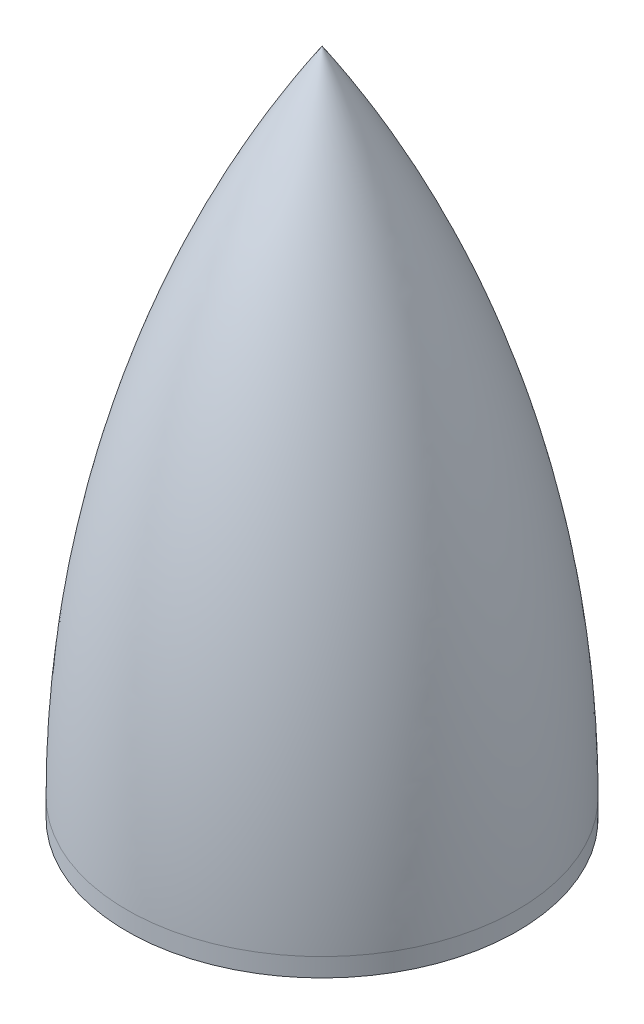
ISO-10303-21;
HEADER;
FILE_DESCRIPTION(('STEP AP214'),'2;1');
FILE_NAME('part.step','',(''),(''),'','','');
FILE_SCHEMA(('AUTOMOTIVE_DESIGN { 1 0 10303 214 1 1 1 1 }'));
ENDSEC;
DATA;
#1=APPLICATION_CONTEXT('core data for automotive mechanical design processes');
#2=APPLICATION_PROTOCOL_DEFINITION('international standard','automotive_design',2000,#1);
#3=PRODUCT_CONTEXT('',#1,'mechanical');
#4=PRODUCT('Part','Part','',(#3));
#5=PRODUCT_RELATED_PRODUCT_CATEGORY('part','',(#4));
#6=PRODUCT_DEFINITION_FORMATION('','',#4);
#7=PRODUCT_DEFINITION_CONTEXT('part definition',#1,'design');
#8=PRODUCT_DEFINITION('design','',#6,#7);
#9=PRODUCT_DEFINITION_SHAPE('','',#8);
#10=(LENGTH_UNIT() NAMED_UNIT(*) SI_UNIT(.MILLI.,.METRE.));
#11=(NAMED_UNIT(*) PLANE_ANGLE_UNIT() SI_UNIT($,.RADIAN.));
#12=(NAMED_UNIT(*) SI_UNIT($,.STERADIAN.) SOLID_ANGLE_UNIT());
#13=UNCERTAINTY_MEASURE_WITH_UNIT(LENGTH_MEASURE(1.E-05),#10,'distance_accuracy_value','');
#14=(GEOMETRIC_REPRESENTATION_CONTEXT(3) GLOBAL_UNCERTAINTY_ASSIGNED_CONTEXT((#13)) GLOBAL_UNIT_ASSIGNED_CONTEXT((#10,
#11,#12)) REPRESENTATION_CONTEXT('',''));
#15=CARTESIAN_POINT('',(0.,0.,0.));
#16=DIRECTION('',(0.,0.,1.));
#17=DIRECTION('',(1.,0.,0.));
#18=AXIS2_PLACEMENT_3D('',#15,#16,#17);
#19=CARTESIAN_POINT('',(0.,0.,0.));
#20=DIRECTION('',(0.,-1.,0.));
#21=DIRECTION('',(0.,0.,-1.));
#22=AXIS2_PLACEMENT_3D('',#19,#20,#21);
#23=CYLINDRICAL_SURFACE('',#22,22.225);
#24=CARTESIAN_POINT('',(0.,0.,0.));
#25=DIRECTION('',(0.,-1.,0.));
#26=DIRECTION('',(0.,0.,-1.));
#27=AXIS2_PLACEMENT_3D('',#24,#25,#26);
#28=CIRCLE('',#27,22.225);
#29=CARTESIAN_POINT('',(0.,0.,-22.225));
#30=VERTEX_POINT('',#29);
#31=EDGE_CURVE('E67',#30,#30,#28,.T.);
#32=ORIENTED_EDGE('',*,*,#31,.F.);
#33=EDGE_LOOP('',(#32));
#34=FACE_BOUND('',#33,.T.);
#35=CARTESIAN_POINT('',(0.,2.10820000000002,0.));
#36=DIRECTION('',(0.,-1.,0.));
#37=DIRECTION('',(0.,0.,-1.));
#38=AXIS2_PLACEMENT_3D('',#35,#36,#37);
#39=CIRCLE('',#38,22.225);
#40=CARTESIAN_POINT('',(0.,2.10820000000002,-22.225));
#41=VERTEX_POINT('',#40);
#42=EDGE_CURVE('E11',#41,#41,#39,.T.);
#43=ORIENTED_EDGE('',*,*,#42,.T.);
#44=EDGE_LOOP('',(#43));
#45=FACE_BOUND('',#44,.T.);
#46=ADVANCED_FACE('F32',(#34,#45),#23,.T.);
#47=CARTESIAN_POINT('',(0.,2.10820000000002,112.387946057143));
#48=DIRECTION('',(-1.,0.,0.));
#49=DIRECTION('',(0.,0.,-1.));
#50=AXIS2_PLACEMENT_3D('',#47,#48,#49);
#51=CIRCLE('',#50,134.612946057143);
#52=TRIMMED_CURVE('',#51,(PARAMETER_VALUE(-0.58285068598359)),
(PARAMETER_VALUE(0.58285068598359)),.T.,.PARAMETER.);
#53=CARTESIAN_POINT('',(0.,2.10820000000002,0.));
#54=DIRECTION('',(0.,-1.,0.));
#55=AXIS1_PLACEMENT('',#53,#54);
#56=SURFACE_OF_REVOLUTION('',#52,#55);
#57=ORIENTED_EDGE('',*,*,#42,.F.);
#58=EDGE_LOOP('',(#57));
#59=FACE_BOUND('',#58,.T.);
#60=CARTESIAN_POINT('',(0.,76.2,0.));
#61=VERTEX_POINT('',#60);
#62=VERTEX_LOOP('',#61);
#63=FACE_BOUND('',#62,.T.);
#64=ADVANCED_FACE('F49',(#59,#63),#56,.T.);
#65=CARTESIAN_POINT('',(0.,1.35439926698562,113.427235487483));
#66=DIRECTION('',(-1.,0.,0.));
#67=DIRECTION('',(0.,0.,-1.));
#68=AXIS2_PLACEMENT_3D('',#65,#66,#67);
#69=CIRCLE('',#68,134.612946057143);
#70=TRIMMED_CURVE('',#69,(PARAMETER_VALUE(-0.568670661398553)),
(PARAMETER_VALUE(0.568670661398553)),.T.,.PARAMETER.);
#71=CARTESIAN_POINT('',(0.,1.35439926698562,0.));
#72=DIRECTION('',(0.,-1.,0.));
#73=AXIS1_PLACEMENT('',#71,#72);
#74=SURFACE_OF_REVOLUTION('',#70,#73);
#75=CARTESIAN_POINT('',(0.,73.8451400264121,0.));
#76=VERTEX_POINT('',#75);
#77=VERTEX_LOOP('',#76);
#78=FACE_BOUND('',#77,.T.);
#79=CARTESIAN_POINT('',(0.,2.1082,0.));
#80=DIRECTION('',(0.,-1.,0.));
#81=DIRECTION('',(0.,0.,-1.));
#82=AXIS2_PLACEMENT_3D('',#79,#80,#81);
#83=CIRCLE('',#82,21.1836);
#84=CARTESIAN_POINT('',(0.,2.1082,-21.1836));
#85=VERTEX_POINT('',#84);
#86=EDGE_CURVE('E39',#85,#85,#83,.T.);
#87=ORIENTED_EDGE('',*,*,#86,.T.);
#88=EDGE_LOOP('',(#87));
#89=FACE_BOUND('',#88,.T.);
#90=ADVANCED_FACE('F45',(#78,#89),#74,.F.);
#91=CARTESIAN_POINT('',(6.35,2.1082,0.));
#92=DIRECTION('',(0.,-1.,0.));
#93=DIRECTION('',(0.,0.,-1.));
#94=AXIS2_PLACEMENT_3D('',#91,#92,#93);
#95=PLANE('',#94);
#96=ORIENTED_EDGE('',*,*,#86,.F.);
#97=EDGE_LOOP('',(#96));
#98=FACE_BOUND('',#97,.T.);
#99=CARTESIAN_POINT('',(0.,2.1082,0.));
#100=DIRECTION('',(0.,-1.,0.));
#101=DIRECTION('',(0.,0.,-1.));
#102=AXIS2_PLACEMENT_3D('',#99,#100,#101);
#103=CIRCLE('',#102,6.35);
#104=CARTESIAN_POINT('',(0.,2.1082,-6.35));
#105=VERTEX_POINT('',#104);
#106=EDGE_CURVE('E54',#105,#105,#103,.T.);
#107=ORIENTED_EDGE('',*,*,#106,.T.);
#108=EDGE_LOOP('',(#107));
#109=FACE_BOUND('',#108,.T.);
#110=ADVANCED_FACE('F48',(#98,#109),#95,.F.);
#111=CARTESIAN_POINT('',(0.,0.,0.));
#112=DIRECTION('',(0.,-1.,0.));
#113=DIRECTION('',(0.,0.,-1.));
#114=AXIS2_PLACEMENT_3D('',#111,#112,#113);
#115=CYLINDRICAL_SURFACE('',#114,6.35);
#116=ORIENTED_EDGE('',*,*,#106,.F.);
#117=EDGE_LOOP('',(#116));
#118=FACE_BOUND('',#117,.T.);
#119=CARTESIAN_POINT('',(0.,6.35,0.));
#120=DIRECTION('',(0.,-1.,0.));
#121=DIRECTION('',(0.,0.,-1.));
#122=AXIS2_PLACEMENT_3D('',#119,#120,#121);
#123=CIRCLE('',#122,6.35);
#124=CARTESIAN_POINT('',(0.,6.35,-6.35));
#125=VERTEX_POINT('',#124);
#126=EDGE_CURVE('E56',#125,#125,#123,.T.);
#127=ORIENTED_EDGE('',*,*,#126,.T.);
#128=EDGE_LOOP('',(#127));
#129=FACE_BOUND('',#128,.T.);
#130=ADVANCED_FACE('F83',(#118,#129),#115,.T.);
#131=CARTESIAN_POINT('',(1.5875,6.35,0.));
#132=DIRECTION('',(0.,-1.,0.));
#133=DIRECTION('',(0.,0.,-1.));
#134=AXIS2_PLACEMENT_3D('',#131,#132,#133);
#135=PLANE('',#134);
#136=ORIENTED_EDGE('',*,*,#126,.F.);
#137=EDGE_LOOP('',(#136));
#138=FACE_BOUND('',#137,.T.);
#139=CARTESIAN_POINT('',(0.,6.35,0.));
#140=DIRECTION('',(0.,-1.,0.));
#141=DIRECTION('',(0.,0.,-1.));
#142=AXIS2_PLACEMENT_3D('',#139,#140,#141);
#143=CIRCLE('',#142,1.5875);
#144=CARTESIAN_POINT('',(0.,6.35,-1.5875));
#145=VERTEX_POINT('',#144);
#146=EDGE_CURVE('E61',#145,#145,#143,.T.);
#147=ORIENTED_EDGE('',*,*,#146,.T.);
#148=EDGE_LOOP('',(#147));
#149=FACE_BOUND('',#148,.T.);
#150=ADVANCED_FACE('F86',(#138,#149),#135,.F.);
#151=CARTESIAN_POINT('',(0.,0.,0.));
#152=DIRECTION('',(0.,-1.,0.));
#153=DIRECTION('',(0.,0.,-1.));
#154=AXIS2_PLACEMENT_3D('',#151,#152,#153);
#155=CYLINDRICAL_SURFACE('',#154,1.5875);
#156=ORIENTED_EDGE('',*,*,#146,.F.);
#157=EDGE_LOOP('',(#156));
#158=FACE_BOUND('',#157,.T.);
#159=CARTESIAN_POINT('',(0.,0.,0.));
#160=DIRECTION('',(0.,-1.,0.));
#161=DIRECTION('',(0.,0.,-1.));
#162=AXIS2_PLACEMENT_3D('',#159,#160,#161);
#163=CIRCLE('',#162,1.5875);
#164=CARTESIAN_POINT('',(0.,0.,-1.5875));
#165=VERTEX_POINT('',#164);
#166=EDGE_CURVE('E64',#165,#165,#163,.T.);
#167=ORIENTED_EDGE('',*,*,#166,.T.);
#168=EDGE_LOOP('',(#167));
#169=FACE_BOUND('',#168,.T.);
#170=ADVANCED_FACE('F90',(#158,#169),#155,.F.);
#171=CARTESIAN_POINT('',(1.5875,0.,0.));
#172=DIRECTION('',(0.,1.,0.));
#173=DIRECTION('',(0.,0.,1.));
#174=AXIS2_PLACEMENT_3D('',#171,#172,#173);
#175=PLANE('',#174);
#176=ORIENTED_EDGE('',*,*,#166,.F.);
#177=EDGE_LOOP('',(#176));
#178=FACE_BOUND('',#177,.T.);
#179=ORIENTED_EDGE('',*,*,#31,.T.);
#180=EDGE_LOOP('',(#179));
#181=FACE_BOUND('',#180,.T.);
#182=ADVANCED_FACE('F71',(#178,#181),#175,.F.);
#183=CLOSED_SHELL('',(#46,#64,#90,#110,#130,#150,#170,#182));
#184=MANIFOLD_SOLID_BREP('B2',#183);
#185=ADVANCED_BREP_SHAPE_REPRESENTATION('',(#18,#184),#14);
#186=SHAPE_DEFINITION_REPRESENTATION(#9,#185);
ENDSEC;
END-ISO-10303-21;
